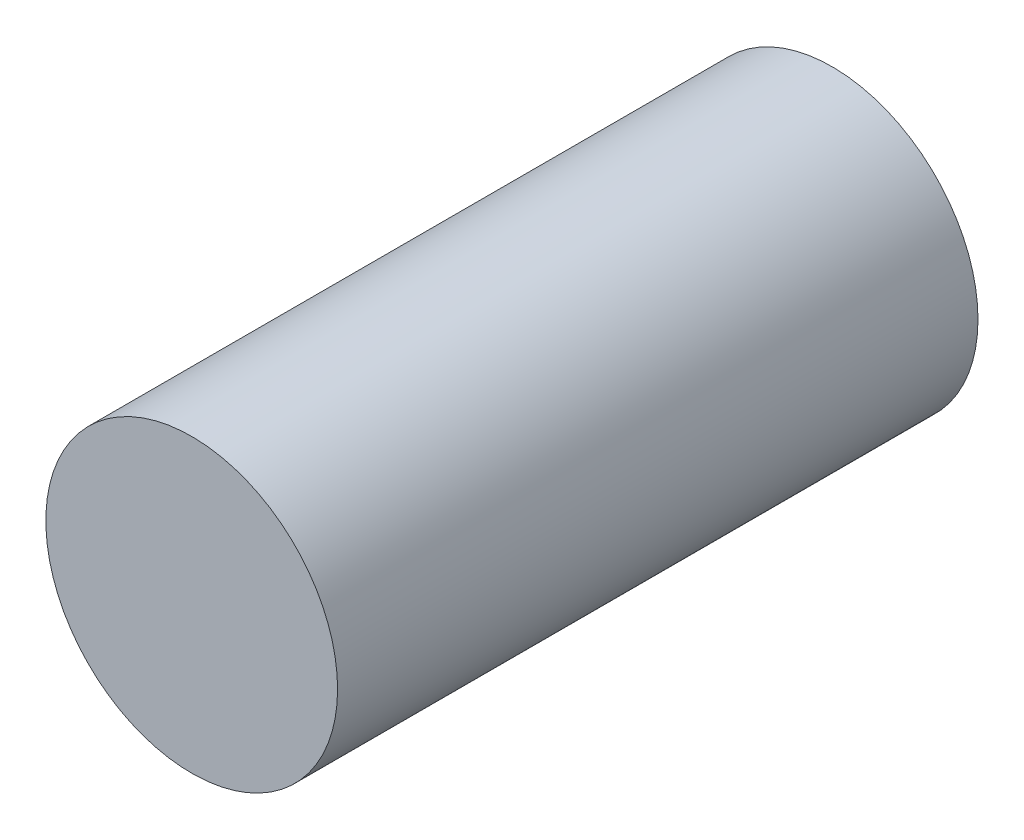
ISO-10303-21;
HEADER;
FILE_DESCRIPTION(('STEP AP214'),'2;1');
FILE_NAME('part.step','',(''),(''),'','','');
FILE_SCHEMA(('AUTOMOTIVE_DESIGN { 1 0 10303 214 1 1 1 1 }'));
ENDSEC;
DATA;
#1=APPLICATION_CONTEXT('core data for automotive mechanical design processes');
#2=APPLICATION_PROTOCOL_DEFINITION('international standard','automotive_design',2000,#1);
#3=PRODUCT_CONTEXT('',#1,'mechanical');
#4=PRODUCT('Part','Part','',(#3));
#5=PRODUCT_RELATED_PRODUCT_CATEGORY('part','',(#4));
#6=PRODUCT_DEFINITION_FORMATION('','',#4);
#7=PRODUCT_DEFINITION_CONTEXT('part definition',#1,'design');
#8=PRODUCT_DEFINITION('design','',#6,#7);
#9=PRODUCT_DEFINITION_SHAPE('','',#8);
#10=(LENGTH_UNIT() NAMED_UNIT(*) SI_UNIT(.MILLI.,.METRE.));
#11=(NAMED_UNIT(*) PLANE_ANGLE_UNIT() SI_UNIT($,.RADIAN.));
#12=(NAMED_UNIT(*) SI_UNIT($,.STERADIAN.) SOLID_ANGLE_UNIT());
#13=UNCERTAINTY_MEASURE_WITH_UNIT(LENGTH_MEASURE(1.E-05),#10,'distance_accuracy_value','');
#14=(GEOMETRIC_REPRESENTATION_CONTEXT(3) GLOBAL_UNCERTAINTY_ASSIGNED_CONTEXT((#13)) GLOBAL_UNIT_ASSIGNED_CONTEXT((#10,
#11,#12)) REPRESENTATION_CONTEXT('',''));
#15=CARTESIAN_POINT('',(0.,0.,0.));
#16=DIRECTION('',(0.,0.,1.));
#17=DIRECTION('',(1.,0.,0.));
#18=AXIS2_PLACEMENT_3D('',#15,#16,#17);
#19=CARTESIAN_POINT('',(-5.08,1.27,0.1));
#20=DIRECTION('',(0.,0.,1.));
#21=DIRECTION('',(1.,0.,0.));
#22=AXIS2_PLACEMENT_3D('',#19,#20,#21);
#23=PLANE('',#22);
#24=CARTESIAN_POINT('',(-5.08,1.27,0.1));
#25=DIRECTION('',(0.,0.,1.));
#26=DIRECTION('',(1.,0.,0.));
#27=AXIS2_PLACEMENT_3D('',#24,#25,#26);
#28=CIRCLE('',#27,0.41);
#29=CARTESIAN_POINT('',(-4.67,1.27,0.1));
#30=VERTEX_POINT('',#29);
#31=EDGE_CURVE('E17',#30,#30,#28,.F.);
#32=ORIENTED_EDGE('',*,*,#31,.F.);
#33=EDGE_LOOP('',(#32));
#34=FACE_BOUND('',#33,.T.);
#35=ADVANCED_FACE('F14',(#34),#23,.T.);
#36=CARTESIAN_POINT('',(-5.08,1.27,-1.7));
#37=DIRECTION('',(0.,0.,1.));
#38=DIRECTION('',(1.,0.,0.));
#39=AXIS2_PLACEMENT_3D('',#36,#37,#38);
#40=PLANE('',#39);
#41=CARTESIAN_POINT('',(-5.08,1.27,-1.7));
#42=DIRECTION('',(0.,0.,1.));
#43=DIRECTION('',(1.,0.,0.));
#44=AXIS2_PLACEMENT_3D('',#41,#42,#43);
#45=CIRCLE('',#44,0.41);
#46=CARTESIAN_POINT('',(-4.67,1.27,-1.7));
#47=VERTEX_POINT('',#46);
#48=EDGE_CURVE('E10',#47,#47,#45,.T.);
#49=ORIENTED_EDGE('',*,*,#48,.F.);
#50=EDGE_LOOP('',(#49));
#51=FACE_BOUND('',#50,.T.);
#52=ADVANCED_FACE('F29',(#51),#40,.F.);
#53=CARTESIAN_POINT('',(-5.08,1.27,-1.7));
#54=DIRECTION('',(0.,0.,1.));
#55=DIRECTION('',(1.,0.,0.));
#56=AXIS2_PLACEMENT_3D('',#53,#54,#55);
#57=CYLINDRICAL_SURFACE('',#56,0.41);
#58=ORIENTED_EDGE('',*,*,#48,.T.);
#59=EDGE_LOOP('',(#58));
#60=FACE_BOUND('',#59,.T.);
#61=ORIENTED_EDGE('',*,*,#31,.T.);
#62=EDGE_LOOP('',(#61));
#63=FACE_BOUND('',#62,.T.);
#64=ADVANCED_FACE('F26',(#60,#63),#57,.T.);
#65=CLOSED_SHELL('',(#35,#52,#64));
#66=MANIFOLD_SOLID_BREP('B1',#65);
#67=ADVANCED_BREP_SHAPE_REPRESENTATION('',(#18,#66),#14);
#68=SHAPE_DEFINITION_REPRESENTATION(#9,#67);
ENDSEC;
END-ISO-10303-21;
